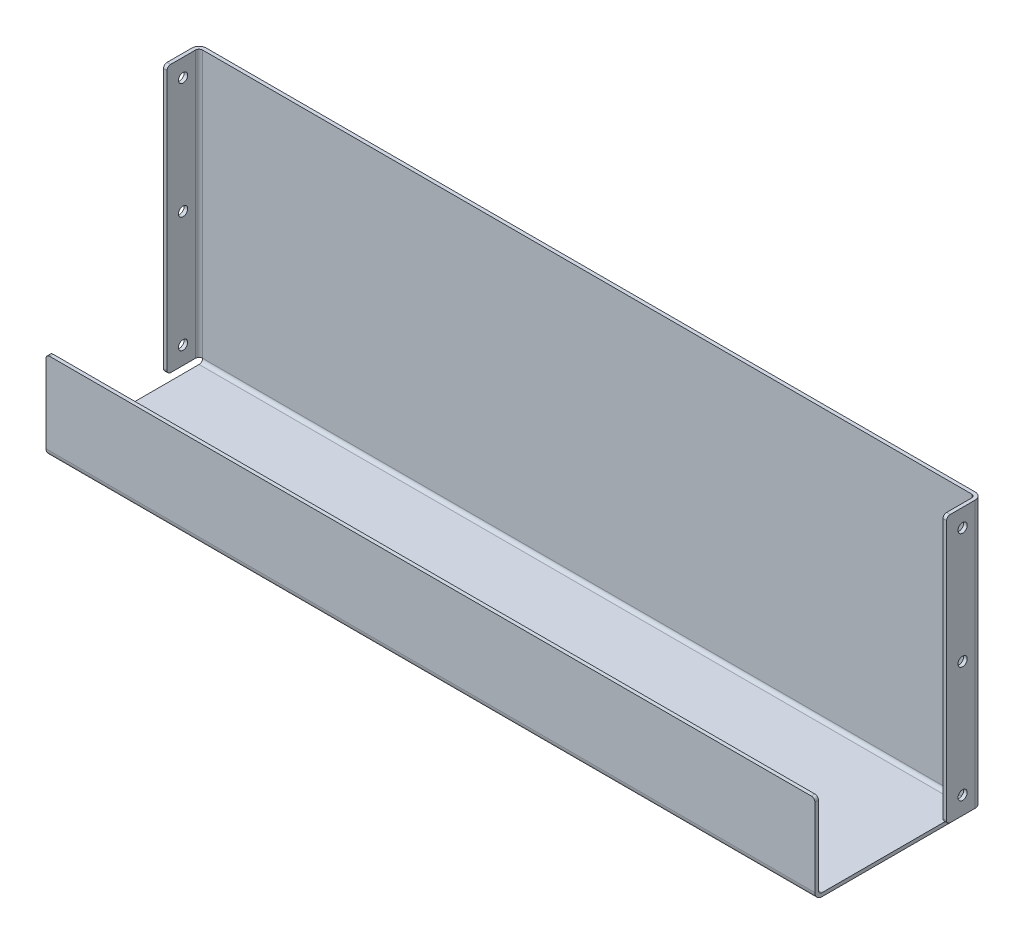
ISO-10303-21;
HEADER;
FILE_DESCRIPTION(('STEP AP214'),'2;1');
FILE_NAME('part.step','',(''),(''),'','','');
FILE_SCHEMA(('AUTOMOTIVE_DESIGN { 1 0 10303 214 1 1 1 1 }'));
ENDSEC;
DATA;
#1=APPLICATION_CONTEXT('core data for automotive mechanical design processes');
#2=APPLICATION_PROTOCOL_DEFINITION('international standard','automotive_design',2000,#1);
#3=PRODUCT_CONTEXT('',#1,'mechanical');
#4=PRODUCT('Part','Part','',(#3));
#5=PRODUCT_RELATED_PRODUCT_CATEGORY('part','',(#4));
#6=PRODUCT_DEFINITION_FORMATION('','',#4);
#7=PRODUCT_DEFINITION_CONTEXT('part definition',#1,'design');
#8=PRODUCT_DEFINITION('design','',#6,#7);
#9=PRODUCT_DEFINITION_SHAPE('','',#8);
#10=(LENGTH_UNIT() NAMED_UNIT(*) SI_UNIT(.MILLI.,.METRE.));
#11=(NAMED_UNIT(*) PLANE_ANGLE_UNIT() SI_UNIT($,.RADIAN.));
#12=(NAMED_UNIT(*) SI_UNIT($,.STERADIAN.) SOLID_ANGLE_UNIT());
#13=UNCERTAINTY_MEASURE_WITH_UNIT(LENGTH_MEASURE(1.E-05),#10,'distance_accuracy_value','');
#14=(GEOMETRIC_REPRESENTATION_CONTEXT(3) GLOBAL_UNCERTAINTY_ASSIGNED_CONTEXT((#13)) GLOBAL_UNIT_ASSIGNED_CONTEXT((#10,
#11,#12)) REPRESENTATION_CONTEXT('',''));
#15=CARTESIAN_POINT('',(0.,0.,0.));
#16=DIRECTION('',(0.,0.,1.));
#17=DIRECTION('',(1.,0.,0.));
#18=AXIS2_PLACEMENT_3D('',#15,#16,#17);
#19=CARTESIAN_POINT('',(0.,0.,88.));
#20=DIRECTION('',(0.,0.,-1.));
#21=DIRECTION('',(-1.,0.,0.));
#22=AXIS2_PLACEMENT_3D('',#19,#20,#21);
#23=PLANE('',#22);
#24=DIRECTION('',(0.,1.,0.));
#25=VECTOR('',#24,1.);
#26=CARTESIAN_POINT('',(-216.,-77.0000000000003,88.));
#27=LINE('',#26,#25);
#28=CARTESIAN_POINT('',(-216.,-75.0000000000003,88.));
#29=VERTEX_POINT('',#28);
#30=CARTESIAN_POINT('',(-216.,-31.0000000000003,88.));
#31=VERTEX_POINT('',#30);
#32=EDGE_CURVE('E185',#29,#31,#27,.T.);
#33=ORIENTED_EDGE('',*,*,#32,.T.);
#34=CARTESIAN_POINT('',(-214.,-31.0000000000003,88.));
#35=DIRECTION('',(0.,0.,-1.));
#36=DIRECTION('',(-1.,0.,0.));
#37=AXIS2_PLACEMENT_3D('',#34,#35,#36);
#38=CIRCLE('',#37,2.);
#39=CARTESIAN_POINT('',(-214.,-29.0000000000003,88.));
#40=VERTEX_POINT('',#39);
#41=EDGE_CURVE('E20',#40,#31,#38,.F.);
#42=ORIENTED_EDGE('',*,*,#41,.F.);
#43=DIRECTION('',(1.,0.,0.));
#44=VECTOR('',#43,1.);
#45=CARTESIAN_POINT('',(-216.,-29.0000000000003,88.));
#46=LINE('',#45,#44);
#47=CARTESIAN_POINT('',(214.,-29.0000000000003,88.));
#48=VERTEX_POINT('',#47);
#49=EDGE_CURVE('E182',#40,#48,#46,.T.);
#50=ORIENTED_EDGE('',*,*,#49,.T.);
#51=CARTESIAN_POINT('',(214.,-31.0000000000003,88.));
#52=DIRECTION('',(0.,0.,-1.));
#53=DIRECTION('',(-1.,0.,0.));
#54=AXIS2_PLACEMENT_3D('',#51,#52,#53);
#55=CIRCLE('',#54,2.);
#56=CARTESIAN_POINT('',(216.,-31.0000000000003,88.));
#57=VERTEX_POINT('',#56);
#58=EDGE_CURVE('E200',#57,#48,#55,.F.);
#59=ORIENTED_EDGE('',*,*,#58,.F.);
#60=DIRECTION('',(0.,1.,0.));
#61=VECTOR('',#60,1.);
#62=CARTESIAN_POINT('',(216.,-29.0000000000003,88.));
#63=LINE('',#62,#61);
#64=CARTESIAN_POINT('',(216.,-75.0000000000003,88.));
#65=VERTEX_POINT('',#64);
#66=EDGE_CURVE('E204',#57,#65,#63,.F.);
#67=ORIENTED_EDGE('',*,*,#66,.T.);
#68=DIRECTION('',(1.,0.,0.));
#69=VECTOR('',#68,1.);
#70=CARTESIAN_POINT('',(216.,-75.0000000000003,88.));
#71=LINE('',#70,#69);
#72=EDGE_CURVE('E338',#65,#29,#71,.F.);
#73=ORIENTED_EDGE('',*,*,#72,.T.);
#74=EDGE_LOOP('',(#33,#42,#50,#59,#67,#73));
#75=FACE_BOUND('',#74,.T.);
#76=ADVANCED_FACE('F17',(#75),#23,.T.);
#77=CARTESIAN_POINT('',(-214.,-31.0000000000003,90.));
#78=DIRECTION('',(0.,0.,-1.));
#79=DIRECTION('',(-1.,0.,0.));
#80=AXIS2_PLACEMENT_3D('',#77,#78,#79);
#81=CYLINDRICAL_SURFACE('',#80,2.);
#82=ORIENTED_EDGE('',*,*,#41,.T.);
#83=DIRECTION('',(0.,0.,-1.));
#84=VECTOR('',#83,1.);
#85=CARTESIAN_POINT('',(-216.,-31.0000000000003,90.));
#86=LINE('',#85,#84);
#87=CARTESIAN_POINT('',(-216.,-31.0000000000003,90.));
#88=VERTEX_POINT('',#87);
#89=EDGE_CURVE('E345',#31,#88,#86,.F.);
#90=ORIENTED_EDGE('',*,*,#89,.T.);
#91=CARTESIAN_POINT('',(-214.,-31.0000000000003,90.));
#92=DIRECTION('',(0.,0.,-1.));
#93=DIRECTION('',(-1.,0.,0.));
#94=AXIS2_PLACEMENT_3D('',#91,#92,#93);
#95=CIRCLE('',#94,2.);
#96=CARTESIAN_POINT('',(-214.,-29.0000000000003,90.));
#97=VERTEX_POINT('',#96);
#98=EDGE_CURVE('E192',#88,#97,#95,.T.);
#99=ORIENTED_EDGE('',*,*,#98,.T.);
#100=DIRECTION('',(0.,0.,-1.));
#101=VECTOR('',#100,1.);
#102=CARTESIAN_POINT('',(-214.,-29.0000000000003,90.));
#103=LINE('',#102,#101);
#104=EDGE_CURVE('E188',#97,#40,#103,.T.);
#105=ORIENTED_EDGE('',*,*,#104,.T.);
#106=EDGE_LOOP('',(#82,#90,#99,#105));
#107=FACE_BOUND('',#106,.T.);
#108=ADVANCED_FACE('F190',(#107),#81,.T.);
#109=CARTESIAN_POINT('',(-216.,-29.0000000000003,90.));
#110=DIRECTION('',(0.,-1.,0.));
#111=DIRECTION('',(0.,0.,-1.));
#112=AXIS2_PLACEMENT_3D('',#109,#110,#111);
#113=PLANE('',#112);
#114=DIRECTION('',(0.,0.,-1.));
#115=VECTOR('',#114,1.);
#116=CARTESIAN_POINT('',(214.,-29.0000000000003,90.));
#117=LINE('',#116,#115);
#118=CARTESIAN_POINT('',(214.,-29.0000000000003,90.));
#119=VERTEX_POINT('',#118);
#120=EDGE_CURVE('E198',#48,#119,#117,.F.);
#121=ORIENTED_EDGE('',*,*,#120,.F.);
#122=ORIENTED_EDGE('',*,*,#49,.F.);
#123=ORIENTED_EDGE('',*,*,#104,.F.);
#124=DIRECTION('',(-1.,0.,0.));
#125=VECTOR('',#124,1.);
#126=CARTESIAN_POINT('',(0.,-29.0000000000003,90.));
#127=LINE('',#126,#125);
#128=EDGE_CURVE('E334',#97,#119,#127,.F.);
#129=ORIENTED_EDGE('',*,*,#128,.T.);
#130=EDGE_LOOP('',(#121,#122,#123,#129));
#131=FACE_BOUND('',#130,.T.);
#132=ADVANCED_FACE('F196',(#131),#113,.F.);
#133=CARTESIAN_POINT('',(214.,-31.0000000000003,90.));
#134=DIRECTION('',(0.,0.,-1.));
#135=DIRECTION('',(-1.,0.,0.));
#136=AXIS2_PLACEMENT_3D('',#133,#134,#135);
#137=CYLINDRICAL_SURFACE('',#136,2.);
#138=ORIENTED_EDGE('',*,*,#58,.T.);
#139=ORIENTED_EDGE('',*,*,#120,.T.);
#140=CARTESIAN_POINT('',(214.,-31.0000000000003,90.));
#141=DIRECTION('',(0.,0.,-1.));
#142=DIRECTION('',(-1.,0.,0.));
#143=AXIS2_PLACEMENT_3D('',#140,#141,#142);
#144=CIRCLE('',#143,2.);
#145=CARTESIAN_POINT('',(216.,-31.0000000000003,90.));
#146=VERTEX_POINT('',#145);
#147=EDGE_CURVE('E332',#119,#146,#144,.T.);
#148=ORIENTED_EDGE('',*,*,#147,.T.);
#149=DIRECTION('',(0.,0.,1.));
#150=VECTOR('',#149,1.);
#151=CARTESIAN_POINT('',(216.,-31.0000000000003,90.));
#152=LINE('',#151,#150);
#153=EDGE_CURVE('E350',#146,#57,#152,.F.);
#154=ORIENTED_EDGE('',*,*,#153,.T.);
#155=EDGE_LOOP('',(#138,#139,#148,#154));
#156=FACE_BOUND('',#155,.T.);
#157=ADVANCED_FACE('F355',(#156),#137,.T.);
#158=CARTESIAN_POINT('',(216.,-75.0000000000003,86.));
#159=DIRECTION('',(1.,0.,0.));
#160=DIRECTION('',(0.,0.,-1.));
#161=AXIS2_PLACEMENT_3D('',#158,#159,#160);
#162=CYLINDRICAL_SURFACE('',#161,2.);
#163=CARTESIAN_POINT('',(-216.,-75.0000000000003,86.));
#164=DIRECTION('',(1.,0.,0.));
#165=DIRECTION('',(0.,0.,-1.));
#166=AXIS2_PLACEMENT_3D('',#163,#164,#165);
#167=CIRCLE('',#166,2.);
#168=CARTESIAN_POINT('',(-216.,-77.0000000000002,86.));
#169=VERTEX_POINT('',#168);
#170=EDGE_CURVE('E328',#29,#169,#167,.T.);
#171=ORIENTED_EDGE('',*,*,#170,.F.);
#172=ORIENTED_EDGE('',*,*,#72,.F.);
#173=CARTESIAN_POINT('',(216.,-75.0000000000003,86.));
#174=DIRECTION('',(1.,0.,0.));
#175=DIRECTION('',(0.,0.,-1.));
#176=AXIS2_PLACEMENT_3D('',#173,#174,#175);
#177=CIRCLE('',#176,2.);
#178=CARTESIAN_POINT('',(216.,-77.0000000000003,86.));
#179=VERTEX_POINT('',#178);
#180=EDGE_CURVE('E337',#65,#179,#177,.T.);
#181=ORIENTED_EDGE('',*,*,#180,.T.);
#182=DIRECTION('',(1.,0.,0.));
#183=VECTOR('',#182,1.);
#184=CARTESIAN_POINT('',(0.,-77.0000000000003,86.));
#185=LINE('',#184,#183);
#186=EDGE_CURVE('E327',#169,#179,#185,.T.);
#187=ORIENTED_EDGE('',*,*,#186,.F.);
#188=EDGE_LOOP('',(#171,#172,#181,#187));
#189=FACE_BOUND('',#188,.T.);
#190=ADVANCED_FACE('F514',(#189),#162,.F.);
#191=CARTESIAN_POINT('',(218.,0.,-6.78469626159817E-13));
#192=DIRECTION('',(-1.,0.,0.));
#193=DIRECTION('',(0.,0.,1.));
#194=AXIS2_PLACEMENT_3D('',#191,#192,#193);
#195=PLANE('',#194);
#196=DIRECTION('',(0.,0.,1.));
#197=VECTOR('',#196,1.);
#198=CARTESIAN_POINT('',(218.,-75.,1.99999999999999));
#199=LINE('',#198,#197);
#200=CARTESIAN_POINT('',(218.,-75.,4.));
#201=VERTEX_POINT('',#200);
#202=CARTESIAN_POINT('',(218.,-75.,18.));
#203=VERTEX_POINT('',#202);
#204=EDGE_CURVE('E375',#201,#203,#199,.T.);
#205=ORIENTED_EDGE('',*,*,#204,.T.);
#206=CARTESIAN_POINT('',(218.,-73.,18.));
#207=DIRECTION('',(-1.,0.,0.));
#208=DIRECTION('',(0.,0.,1.));
#209=AXIS2_PLACEMENT_3D('',#206,#207,#208);
#210=CIRCLE('',#209,2.);
#211=CARTESIAN_POINT('',(218.,-73.,20.));
#212=VERTEX_POINT('',#211);
#213=EDGE_CURVE('E314',#212,#203,#210,.F.);
#214=ORIENTED_EDGE('',*,*,#213,.F.);
#215=DIRECTION('',(0.,1.,0.));
#216=VECTOR('',#215,1.);
#217=CARTESIAN_POINT('',(218.,-75.,20.));
#218=LINE('',#217,#216);
#219=CARTESIAN_POINT('',(218.,73.,20.));
#220=VERTEX_POINT('',#219);
#221=EDGE_CURVE('E313',#212,#220,#218,.T.);
#222=ORIENTED_EDGE('',*,*,#221,.T.);
#223=CARTESIAN_POINT('',(218.,73.,18.));
#224=DIRECTION('',(-1.,0.,0.));
#225=DIRECTION('',(0.,0.,1.));
#226=AXIS2_PLACEMENT_3D('',#223,#224,#225);
#227=CIRCLE('',#226,2.);
#228=CARTESIAN_POINT('',(218.,75.,18.));
#229=VERTEX_POINT('',#228);
#230=EDGE_CURVE('E309',#229,#220,#227,.F.);
#231=ORIENTED_EDGE('',*,*,#230,.F.);
#232=DIRECTION('',(0.,0.,1.));
#233=VECTOR('',#232,1.);
#234=CARTESIAN_POINT('',(218.,75.,20.));
#235=LINE('',#234,#233);
#236=CARTESIAN_POINT('',(218.,75.,4.));
#237=VERTEX_POINT('',#236);
#238=EDGE_CURVE('E373',#229,#237,#235,.F.);
#239=ORIENTED_EDGE('',*,*,#238,.T.);
#240=DIRECTION('',(0.,1.,0.));
#241=VECTOR('',#240,1.);
#242=CARTESIAN_POINT('',(218.,75.,4.));
#243=LINE('',#242,#241);
#244=EDGE_CURVE('E379',#237,#201,#243,.F.);
#245=ORIENTED_EDGE('',*,*,#244,.T.);
#246=EDGE_LOOP('',(#205,#214,#222,#231,#239,#245));
#247=FACE_BOUND('',#246,.T.);
#248=CARTESIAN_POINT('',(218.,65.0000000000001,11.0000000000013));
#249=DIRECTION('',(-1.,0.,0.));
#250=DIRECTION('',(0.,0.,1.));
#251=AXIS2_PLACEMENT_3D('',#248,#249,#250);
#252=CIRCLE('',#251,2.6);
#253=CARTESIAN_POINT('',(218.,65.0000000000001,13.6000000000013));
#254=VERTEX_POINT('',#253);
#255=EDGE_CURVE('E318',#254,#254,#252,.F.);
#256=ORIENTED_EDGE('',*,*,#255,.T.);
#257=EDGE_LOOP('',(#256));
#258=FACE_BOUND('',#257,.T.);
#259=CARTESIAN_POINT('',(218.,0.,11.0000000000013));
#260=DIRECTION('',(-1.,0.,0.));
#261=DIRECTION('',(0.,0.,1.));
#262=AXIS2_PLACEMENT_3D('',#259,#260,#261);
#263=CIRCLE('',#262,2.6);
#264=CARTESIAN_POINT('',(218.,0.,13.6000000000013));
#265=VERTEX_POINT('',#264);
#266=EDGE_CURVE('E321',#265,#265,#263,.F.);
#267=ORIENTED_EDGE('',*,*,#266,.T.);
#268=EDGE_LOOP('',(#267));
#269=FACE_BOUND('',#268,.T.);
#270=CARTESIAN_POINT('',(218.,-64.9999999999999,11.0000000000013));
#271=DIRECTION('',(-1.,0.,0.));
#272=DIRECTION('',(0.,0.,1.));
#273=AXIS2_PLACEMENT_3D('',#270,#271,#272);
#274=CIRCLE('',#273,2.6);
#275=CARTESIAN_POINT('',(218.,-64.9999999999999,13.6000000000013));
#276=VERTEX_POINT('',#275);
#277=EDGE_CURVE('E324',#276,#276,#274,.F.);
#278=ORIENTED_EDGE('',*,*,#277,.T.);
#279=EDGE_LOOP('',(#278));
#280=FACE_BOUND('',#279,.T.);
#281=ADVANCED_FACE('F516',(#247,#258,#269,#280),#195,.T.);
#282=CARTESIAN_POINT('',(0.,0.,90.));
#283=DIRECTION('',(0.,0.,-1.));
#284=DIRECTION('',(-1.,0.,0.));
#285=AXIS2_PLACEMENT_3D('',#282,#283,#284);
#286=PLANE('',#285);
#287=ORIENTED_EDGE('',*,*,#147,.F.);
#288=ORIENTED_EDGE('',*,*,#128,.F.);
#289=ORIENTED_EDGE('',*,*,#98,.F.);
#290=DIRECTION('',(0.,1.,0.));
#291=VECTOR('',#290,1.);
#292=CARTESIAN_POINT('',(-216.,0.,90.));
#293=LINE('',#292,#291);
#294=CARTESIAN_POINT('',(-216.,-75.0000000000003,90.));
#295=VERTEX_POINT('',#294);
#296=EDGE_CURVE('E336',#295,#88,#293,.T.);
#297=ORIENTED_EDGE('',*,*,#296,.F.);
#298=DIRECTION('',(1.,0.,0.));
#299=VECTOR('',#298,1.);
#300=CARTESIAN_POINT('',(216.,-75.0000000000003,90.));
#301=LINE('',#300,#299);
#302=CARTESIAN_POINT('',(216.,-75.0000000000003,90.));
#303=VERTEX_POINT('',#302);
#304=EDGE_CURVE('E304',#303,#295,#301,.F.);
#305=ORIENTED_EDGE('',*,*,#304,.F.);
#306=DIRECTION('',(0.,1.,0.));
#307=VECTOR('',#306,1.);
#308=CARTESIAN_POINT('',(216.,0.,90.));
#309=LINE('',#308,#307);
#310=EDGE_CURVE('E331',#146,#303,#309,.F.);
#311=ORIENTED_EDGE('',*,*,#310,.F.);
#312=EDGE_LOOP('',(#287,#288,#289,#297,#305,#311));
#313=FACE_BOUND('',#312,.T.);
#314=ADVANCED_FACE('F359',(#313),#286,.F.);
#315=CARTESIAN_POINT('',(0.,-77.,-2.60208521396521E-13));
#316=DIRECTION('',(0.,1.,0.));
#317=DIRECTION('',(0.,0.,1.));
#318=AXIS2_PLACEMENT_3D('',#315,#316,#317);
#319=PLANE('',#318);
#320=DIRECTION('',(0.,0.,1.));
#321=VECTOR('',#320,1.);
#322=CARTESIAN_POINT('',(216.,-77.0000000000003,90.));
#323=LINE('',#322,#321);
#324=CARTESIAN_POINT('',(216.,-77.0000000000001,4.));
#325=VERTEX_POINT('',#324);
#326=EDGE_CURVE('E308',#179,#325,#323,.F.);
#327=ORIENTED_EDGE('',*,*,#326,.T.);
#328=DIRECTION('',(1.,0.,0.));
#329=VECTOR('',#328,1.);
#330=CARTESIAN_POINT('',(216.,-77.,3.99999999999999));
#331=LINE('',#330,#329);
#332=CARTESIAN_POINT('',(-216.,-77.,3.99999999999999));
#333=VERTEX_POINT('',#332);
#334=EDGE_CURVE('E299',#325,#333,#331,.F.);
#335=ORIENTED_EDGE('',*,*,#334,.T.);
#336=DIRECTION('',(0.,0.,1.));
#337=VECTOR('',#336,1.);
#338=CARTESIAN_POINT('',(-216.,-77.,1.99999999999997));
#339=LINE('',#338,#337);
#340=EDGE_CURVE('E303',#333,#169,#339,.T.);
#341=ORIENTED_EDGE('',*,*,#340,.T.);
#342=ORIENTED_EDGE('',*,*,#186,.T.);
#343=EDGE_LOOP('',(#327,#335,#341,#342));
#344=FACE_BOUND('',#343,.T.);
#345=ADVANCED_FACE('F511',(#344),#319,.T.);
#346=CARTESIAN_POINT('',(-218.,0.,-6.78469626159818E-13));
#347=DIRECTION('',(1.,0.,0.));
#348=DIRECTION('',(0.,0.,-1.));
#349=AXIS2_PLACEMENT_3D('',#346,#347,#348);
#350=PLANE('',#349);
#351=DIRECTION('',(0.,0.,1.));
#352=VECTOR('',#351,1.);
#353=CARTESIAN_POINT('',(-218.,75.,1.99999999999999));
#354=LINE('',#353,#352);
#355=CARTESIAN_POINT('',(-218.,75.,4.));
#356=VERTEX_POINT('',#355);
#357=CARTESIAN_POINT('',(-218.,75.,18.));
#358=VERTEX_POINT('',#357);
#359=EDGE_CURVE('E397',#356,#358,#354,.T.);
#360=ORIENTED_EDGE('',*,*,#359,.T.);
#361=CARTESIAN_POINT('',(-218.,73.,18.));
#362=DIRECTION('',(1.,0.,0.));
#363=DIRECTION('',(0.,0.,-1.));
#364=AXIS2_PLACEMENT_3D('',#361,#362,#363);
#365=CIRCLE('',#364,2.);
#366=CARTESIAN_POINT('',(-218.,73.,20.));
#367=VERTEX_POINT('',#366);
#368=EDGE_CURVE('E286',#367,#358,#365,.F.);
#369=ORIENTED_EDGE('',*,*,#368,.F.);
#370=DIRECTION('',(0.,1.,0.));
#371=VECTOR('',#370,1.);
#372=CARTESIAN_POINT('',(-218.,75.,20.));
#373=LINE('',#372,#371);
#374=CARTESIAN_POINT('',(-218.,-73.,20.));
#375=VERTEX_POINT('',#374);
#376=EDGE_CURVE('E285',#367,#375,#373,.F.);
#377=ORIENTED_EDGE('',*,*,#376,.T.);
#378=CARTESIAN_POINT('',(-218.,-73.,18.));
#379=DIRECTION('',(1.,0.,0.));
#380=DIRECTION('',(0.,0.,-1.));
#381=AXIS2_PLACEMENT_3D('',#378,#379,#380);
#382=CIRCLE('',#381,2.);
#383=CARTESIAN_POINT('',(-218.,-75.,18.));
#384=VERTEX_POINT('',#383);
#385=EDGE_CURVE('E281',#384,#375,#382,.F.);
#386=ORIENTED_EDGE('',*,*,#385,.F.);
#387=DIRECTION('',(0.,0.,1.));
#388=VECTOR('',#387,1.);
#389=CARTESIAN_POINT('',(-218.,-75.,20.));
#390=LINE('',#389,#388);
#391=CARTESIAN_POINT('',(-218.,-75.,4.));
#392=VERTEX_POINT('',#391);
#393=EDGE_CURVE('E395',#384,#392,#390,.F.);
#394=ORIENTED_EDGE('',*,*,#393,.T.);
#395=DIRECTION('',(0.,-1.,0.));
#396=VECTOR('',#395,1.);
#397=CARTESIAN_POINT('',(-218.,-75.,4.));
#398=LINE('',#397,#396);
#399=EDGE_CURVE('E372',#392,#356,#398,.F.);
#400=ORIENTED_EDGE('',*,*,#399,.T.);
#401=EDGE_LOOP('',(#360,#369,#377,#386,#394,#400));
#402=FACE_BOUND('',#401,.T.);
#403=CARTESIAN_POINT('',(-218.,65.,11.));
#404=DIRECTION('',(-1.,0.,0.));
#405=DIRECTION('',(0.,0.,1.));
#406=AXIS2_PLACEMENT_3D('',#403,#404,#405);
#407=CIRCLE('',#406,2.6);
#408=CARTESIAN_POINT('',(-218.,65.,13.6));
#409=VERTEX_POINT('',#408);
#410=EDGE_CURVE('E290',#409,#409,#407,.T.);
#411=ORIENTED_EDGE('',*,*,#410,.T.);
#412=EDGE_LOOP('',(#411));
#413=FACE_BOUND('',#412,.T.);
#414=CARTESIAN_POINT('',(-218.,0.,11.));
#415=DIRECTION('',(-1.,0.,0.));
#416=DIRECTION('',(0.,0.,1.));
#417=AXIS2_PLACEMENT_3D('',#414,#415,#416);
#418=CIRCLE('',#417,2.6);
#419=CARTESIAN_POINT('',(-218.,0.,13.6));
#420=VERTEX_POINT('',#419);
#421=EDGE_CURVE('E293',#420,#420,#418,.T.);
#422=ORIENTED_EDGE('',*,*,#421,.T.);
#423=EDGE_LOOP('',(#422));
#424=FACE_BOUND('',#423,.T.);
#425=CARTESIAN_POINT('',(-218.,-65.,11.));
#426=DIRECTION('',(-1.,0.,0.));
#427=DIRECTION('',(0.,0.,1.));
#428=AXIS2_PLACEMENT_3D('',#425,#426,#427);
#429=CIRCLE('',#428,2.6);
#430=CARTESIAN_POINT('',(-218.,-65.,13.6));
#431=VERTEX_POINT('',#430);
#432=EDGE_CURVE('E296',#431,#431,#429,.T.);
#433=ORIENTED_EDGE('',*,*,#432,.T.);
#434=EDGE_LOOP('',(#433));
#435=FACE_BOUND('',#434,.T.);
#436=ADVANCED_FACE('F613',(#402,#413,#424,#435),#350,.T.);
#437=CARTESIAN_POINT('',(220.,-64.9999999999999,11.0000000000014));
#438=DIRECTION('',(-1.,0.,0.));
#439=DIRECTION('',(0.,0.,1.));
#440=AXIS2_PLACEMENT_3D('',#437,#438,#439);
#441=CYLINDRICAL_SURFACE('',#440,2.6);
#442=CARTESIAN_POINT('',(220.,-64.9999999999999,11.0000000000014));
#443=DIRECTION('',(-1.,0.,0.));
#444=DIRECTION('',(0.,0.,1.));
#445=AXIS2_PLACEMENT_3D('',#442,#443,#444);
#446=CIRCLE('',#445,2.6);
#447=CARTESIAN_POINT('',(220.,-64.9999999999999,13.6000000000014));
#448=VERTEX_POINT('',#447);
#449=EDGE_CURVE('E275',#448,#448,#446,.F.);
#450=ORIENTED_EDGE('',*,*,#449,.T.);
#451=EDGE_LOOP('',(#450));
#452=FACE_BOUND('',#451,.T.);
#453=ORIENTED_EDGE('',*,*,#277,.F.);
#454=EDGE_LOOP('',(#453));
#455=FACE_BOUND('',#454,.T.);
#456=ADVANCED_FACE('F609',(#452,#455),#441,.F.);
#457=CARTESIAN_POINT('',(220.,0.,11.0000000000014));
#458=DIRECTION('',(-1.,0.,0.));
#459=DIRECTION('',(0.,0.,1.));
#460=AXIS2_PLACEMENT_3D('',#457,#458,#459);
#461=CYLINDRICAL_SURFACE('',#460,2.6);
#462=CARTESIAN_POINT('',(220.,0.,11.0000000000014));
#463=DIRECTION('',(-1.,0.,0.));
#464=DIRECTION('',(0.,0.,1.));
#465=AXIS2_PLACEMENT_3D('',#462,#463,#464);
#466=CIRCLE('',#465,2.6);
#467=CARTESIAN_POINT('',(220.,0.,13.6000000000014));
#468=VERTEX_POINT('',#467);
#469=EDGE_CURVE('E272',#468,#468,#466,.F.);
#470=ORIENTED_EDGE('',*,*,#469,.T.);
#471=EDGE_LOOP('',(#470));
#472=FACE_BOUND('',#471,.T.);
#473=ORIENTED_EDGE('',*,*,#266,.F.);
#474=EDGE_LOOP('',(#473));
#475=FACE_BOUND('',#474,.T.);
#476=ADVANCED_FACE('F605',(#472,#475),#461,.F.);
#477=CARTESIAN_POINT('',(220.,65.0000000000001,11.0000000000013));
#478=DIRECTION('',(-1.,0.,0.));
#479=DIRECTION('',(0.,0.,1.));
#480=AXIS2_PLACEMENT_3D('',#477,#478,#479);
#481=CYLINDRICAL_SURFACE('',#480,2.6);
#482=CARTESIAN_POINT('',(220.,65.0000000000001,11.0000000000013));
#483=DIRECTION('',(-1.,0.,0.));
#484=DIRECTION('',(0.,0.,1.));
#485=AXIS2_PLACEMENT_3D('',#482,#483,#484);
#486=CIRCLE('',#485,2.6);
#487=CARTESIAN_POINT('',(220.,65.0000000000001,13.6000000000013));
#488=VERTEX_POINT('',#487);
#489=EDGE_CURVE('E269',#488,#488,#486,.F.);
#490=ORIENTED_EDGE('',*,*,#489,.T.);
#491=EDGE_LOOP('',(#490));
#492=FACE_BOUND('',#491,.T.);
#493=ORIENTED_EDGE('',*,*,#255,.F.);
#494=EDGE_LOOP('',(#493));
#495=FACE_BOUND('',#494,.T.);
#496=ADVANCED_FACE('F601',(#492,#495),#481,.F.);
#497=CARTESIAN_POINT('',(220.,-73.,18.));
#498=DIRECTION('',(-1.,0.,0.));
#499=DIRECTION('',(0.,0.,1.));
#500=AXIS2_PLACEMENT_3D('',#497,#498,#499);
#501=CYLINDRICAL_SURFACE('',#500,2.);
#502=ORIENTED_EDGE('',*,*,#213,.T.);
#503=DIRECTION('',(-1.,0.,0.));
#504=VECTOR('',#503,1.);
#505=CARTESIAN_POINT('',(220.,-75.,18.));
#506=LINE('',#505,#504);
#507=CARTESIAN_POINT('',(220.,-75.,18.));
#508=VERTEX_POINT('',#507);
#509=EDGE_CURVE('E377',#203,#508,#506,.F.);
#510=ORIENTED_EDGE('',*,*,#509,.T.);
#511=CARTESIAN_POINT('',(220.,-73.,18.));
#512=DIRECTION('',(-1.,0.,0.));
#513=DIRECTION('',(0.,0.,1.));
#514=AXIS2_PLACEMENT_3D('',#511,#512,#513);
#515=CIRCLE('',#514,2.);
#516=CARTESIAN_POINT('',(220.,-73.,20.));
#517=VERTEX_POINT('',#516);
#518=EDGE_CURVE('E266',#508,#517,#515,.T.);
#519=ORIENTED_EDGE('',*,*,#518,.T.);
#520=DIRECTION('',(-1.,0.,0.));
#521=VECTOR('',#520,1.);
#522=CARTESIAN_POINT('',(220.,-73.,20.));
#523=LINE('',#522,#521);
#524=EDGE_CURVE('E317',#517,#212,#523,.T.);
#525=ORIENTED_EDGE('',*,*,#524,.T.);
#526=EDGE_LOOP('',(#502,#510,#519,#525));
#527=FACE_BOUND('',#526,.T.);
#528=ADVANCED_FACE('F597',(#527),#501,.T.);
#529=CARTESIAN_POINT('',(220.,-75.,20.));
#530=DIRECTION('',(0.,0.,-1.));
#531=DIRECTION('',(-1.,0.,0.));
#532=AXIS2_PLACEMENT_3D('',#529,#530,#531);
#533=PLANE('',#532);
#534=DIRECTION('',(-1.,0.,0.));
#535=VECTOR('',#534,1.);
#536=CARTESIAN_POINT('',(220.,73.,20.));
#537=LINE('',#536,#535);
#538=CARTESIAN_POINT('',(220.,73.,20.));
#539=VERTEX_POINT('',#538);
#540=EDGE_CURVE('E312',#220,#539,#537,.F.);
#541=ORIENTED_EDGE('',*,*,#540,.F.);
#542=ORIENTED_EDGE('',*,*,#221,.F.);
#543=ORIENTED_EDGE('',*,*,#524,.F.);
#544=DIRECTION('',(0.,1.,0.));
#545=VECTOR('',#544,1.);
#546=CARTESIAN_POINT('',(220.,0.,20.));
#547=LINE('',#546,#545);
#548=EDGE_CURVE('E265',#517,#539,#547,.T.);
#549=ORIENTED_EDGE('',*,*,#548,.T.);
#550=EDGE_LOOP('',(#541,#542,#543,#549));
#551=FACE_BOUND('',#550,.T.);
#552=ADVANCED_FACE('F593',(#551),#533,.F.);
#553=CARTESIAN_POINT('',(220.,73.,18.));
#554=DIRECTION('',(-1.,0.,0.));
#555=DIRECTION('',(0.,0.,1.));
#556=AXIS2_PLACEMENT_3D('',#553,#554,#555);
#557=CYLINDRICAL_SURFACE('',#556,2.);
#558=ORIENTED_EDGE('',*,*,#230,.T.);
#559=ORIENTED_EDGE('',*,*,#540,.T.);
#560=CARTESIAN_POINT('',(220.,73.,18.));
#561=DIRECTION('',(-1.,0.,0.));
#562=DIRECTION('',(0.,0.,1.));
#563=AXIS2_PLACEMENT_3D('',#560,#561,#562);
#564=CIRCLE('',#563,2.);
#565=CARTESIAN_POINT('',(220.,75.,18.));
#566=VERTEX_POINT('',#565);
#567=EDGE_CURVE('E263',#539,#566,#564,.T.);
#568=ORIENTED_EDGE('',*,*,#567,.T.);
#569=DIRECTION('',(1.,0.,0.));
#570=VECTOR('',#569,1.);
#571=CARTESIAN_POINT('',(220.,75.,18.));
#572=LINE('',#571,#570);
#573=EDGE_CURVE('E376',#566,#229,#572,.F.);
#574=ORIENTED_EDGE('',*,*,#573,.T.);
#575=EDGE_LOOP('',(#558,#559,#568,#574));
#576=FACE_BOUND('',#575,.T.);
#577=ADVANCED_FACE('F590',(#576),#557,.T.);
#578=CARTESIAN_POINT('',(216.,75.,4.00000000000001));
#579=DIRECTION('',(0.,1.,0.));
#580=DIRECTION('',(0.,0.,1.));
#581=AXIS2_PLACEMENT_3D('',#578,#579,#580);
#582=CYLINDRICAL_SURFACE('',#581,2.);
#583=CARTESIAN_POINT('',(216.,-75.,4.00000000000001));
#584=DIRECTION('',(0.,1.,0.));
#585=DIRECTION('',(0.,0.,1.));
#586=AXIS2_PLACEMENT_3D('',#583,#584,#585);
#587=CIRCLE('',#586,2.);
#588=CARTESIAN_POINT('',(216.,-75.,1.99999999999999));
#589=VERTEX_POINT('',#588);
#590=EDGE_CURVE('E259',#201,#589,#587,.T.);
#591=ORIENTED_EDGE('',*,*,#590,.F.);
#592=ORIENTED_EDGE('',*,*,#244,.F.);
#593=CARTESIAN_POINT('',(216.,75.,4.00000000000001));
#594=DIRECTION('',(0.,1.,0.));
#595=DIRECTION('',(0.,0.,1.));
#596=AXIS2_PLACEMENT_3D('',#593,#594,#595);
#597=CIRCLE('',#596,2.);
#598=CARTESIAN_POINT('',(216.,75.,2.));
#599=VERTEX_POINT('',#598);
#600=EDGE_CURVE('E278',#237,#599,#597,.T.);
#601=ORIENTED_EDGE('',*,*,#600,.T.);
#602=DIRECTION('',(0.,1.,0.));
#603=VECTOR('',#602,1.);
#604=CARTESIAN_POINT('',(216.,0.,2.));
#605=LINE('',#604,#603);
#606=EDGE_CURVE('E280',#599,#589,#605,.F.);
#607=ORIENTED_EDGE('',*,*,#606,.T.);
#608=EDGE_LOOP('',(#591,#592,#601,#607));
#609=FACE_BOUND('',#608,.T.);
#610=ADVANCED_FACE('F587',(#609),#582,.F.);
#611=CARTESIAN_POINT('',(216.,-75.0000000000003,86.));
#612=DIRECTION('',(1.,0.,0.));
#613=DIRECTION('',(0.,0.,-1.));
#614=AXIS2_PLACEMENT_3D('',#611,#612,#613);
#615=CYLINDRICAL_SURFACE('',#614,4.);
#616=ORIENTED_EDGE('',*,*,#304,.T.);
#617=CARTESIAN_POINT('',(-216.,-75.0000000000003,86.));
#618=DIRECTION('',(1.,0.,0.));
#619=DIRECTION('',(0.,0.,-1.));
#620=AXIS2_PLACEMENT_3D('',#617,#618,#619);
#621=CIRCLE('',#620,4.);
#622=CARTESIAN_POINT('',(-216.,-79.0000000000003,86.));
#623=VERTEX_POINT('',#622);
#624=EDGE_CURVE('E300',#295,#623,#621,.T.);
#625=ORIENTED_EDGE('',*,*,#624,.T.);
#626=DIRECTION('',(1.,0.,0.));
#627=VECTOR('',#626,1.);
#628=CARTESIAN_POINT('',(0.,-79.0000000000003,86.));
#629=LINE('',#628,#627);
#630=CARTESIAN_POINT('',(216.,-79.0000000000003,86.));
#631=VERTEX_POINT('',#630);
#632=EDGE_CURVE('E253',#623,#631,#629,.T.);
#633=ORIENTED_EDGE('',*,*,#632,.T.);
#634=CARTESIAN_POINT('',(216.,-75.0000000000003,86.));
#635=DIRECTION('',(1.,0.,0.));
#636=DIRECTION('',(0.,0.,-1.));
#637=AXIS2_PLACEMENT_3D('',#634,#635,#636);
#638=CIRCLE('',#637,4.);
#639=EDGE_CURVE('E305',#631,#303,#638,.F.);
#640=ORIENTED_EDGE('',*,*,#639,.T.);
#641=EDGE_LOOP('',(#616,#625,#633,#640));
#642=FACE_BOUND('',#641,.T.);
#643=ADVANCED_FACE('F474',(#642),#615,.T.);
#644=CARTESIAN_POINT('',(216.,-75.,4.));
#645=DIRECTION('',(1.,0.,0.));
#646=DIRECTION('',(0.,0.,-1.));
#647=AXIS2_PLACEMENT_3D('',#644,#645,#646);
#648=CYLINDRICAL_SURFACE('',#647,2.00000000000002);
#649=CARTESIAN_POINT('',(-216.,-75.,4.));
#650=DIRECTION('',(1.,0.,0.));
#651=DIRECTION('',(0.,0.,-1.));
#652=AXIS2_PLACEMENT_3D('',#649,#650,#651);
#653=CIRCLE('',#652,2.00000000000002);
#654=CARTESIAN_POINT('',(-216.,-75.,2.));
#655=VERTEX_POINT('',#654);
#656=EDGE_CURVE('E251',#333,#655,#653,.T.);
#657=ORIENTED_EDGE('',*,*,#656,.F.);
#658=ORIENTED_EDGE('',*,*,#334,.F.);
#659=CARTESIAN_POINT('',(216.,-75.,4.));
#660=DIRECTION('',(1.,0.,0.));
#661=DIRECTION('',(0.,0.,-1.));
#662=AXIS2_PLACEMENT_3D('',#659,#660,#661);
#663=CIRCLE('',#662,2.00000000000002);
#664=EDGE_CURVE('E254',#325,#589,#663,.T.);
#665=ORIENTED_EDGE('',*,*,#664,.T.);
#666=DIRECTION('',(-1.,0.,0.));
#667=VECTOR('',#666,1.);
#668=CARTESIAN_POINT('',(0.,-75.,2.));
#669=LINE('',#668,#667);
#670=EDGE_CURVE('E369',#589,#655,#669,.T.);
#671=ORIENTED_EDGE('',*,*,#670,.T.);
#672=EDGE_LOOP('',(#657,#658,#665,#671));
#673=FACE_BOUND('',#672,.T.);
#674=ADVANCED_FACE('F499',(#673),#648,.F.);
#675=CARTESIAN_POINT('',(220.,-64.9999999999999,11.0000000000014));
#676=DIRECTION('',(-1.,0.,0.));
#677=DIRECTION('',(0.,0.,1.));
#678=AXIS2_PLACEMENT_3D('',#675,#676,#677);
#679=CYLINDRICAL_SURFACE('',#678,2.6);
#680=ORIENTED_EDGE('',*,*,#432,.F.);
#681=EDGE_LOOP('',(#680));
#682=FACE_BOUND('',#681,.T.);
#683=CARTESIAN_POINT('',(-220.,-65.,11.));
#684=DIRECTION('',(-1.,0.,0.));
#685=DIRECTION('',(0.,0.,1.));
#686=AXIS2_PLACEMENT_3D('',#683,#684,#685);
#687=CIRCLE('',#686,2.6);
#688=CARTESIAN_POINT('',(-220.,-65.,13.6));
#689=VERTEX_POINT('',#688);
#690=EDGE_CURVE('E245',#689,#689,#687,.T.);
#691=ORIENTED_EDGE('',*,*,#690,.T.);
#692=EDGE_LOOP('',(#691));
#693=FACE_BOUND('',#692,.T.);
#694=ADVANCED_FACE('F578',(#682,#693),#679,.F.);
#695=CARTESIAN_POINT('',(220.,0.,11.0000000000014));
#696=DIRECTION('',(-1.,0.,0.));
#697=DIRECTION('',(0.,0.,1.));
#698=AXIS2_PLACEMENT_3D('',#695,#696,#697);
#699=CYLINDRICAL_SURFACE('',#698,2.6);
#700=ORIENTED_EDGE('',*,*,#421,.F.);
#701=EDGE_LOOP('',(#700));
#702=FACE_BOUND('',#701,.T.);
#703=CARTESIAN_POINT('',(-220.,0.,11.));
#704=DIRECTION('',(-1.,0.,0.));
#705=DIRECTION('',(0.,0.,1.));
#706=AXIS2_PLACEMENT_3D('',#703,#704,#705);
#707=CIRCLE('',#706,2.6);
#708=CARTESIAN_POINT('',(-220.,0.,13.6));
#709=VERTEX_POINT('',#708);
#710=EDGE_CURVE('E242',#709,#709,#707,.T.);
#711=ORIENTED_EDGE('',*,*,#710,.T.);
#712=EDGE_LOOP('',(#711));
#713=FACE_BOUND('',#712,.T.);
#714=ADVANCED_FACE('F574',(#702,#713),#699,.F.);
#715=CARTESIAN_POINT('',(220.,65.0000000000001,11.0000000000013));
#716=DIRECTION('',(-1.,0.,0.));
#717=DIRECTION('',(0.,0.,1.));
#718=AXIS2_PLACEMENT_3D('',#715,#716,#717);
#719=CYLINDRICAL_SURFACE('',#718,2.6);
#720=ORIENTED_EDGE('',*,*,#410,.F.);
#721=EDGE_LOOP('',(#720));
#722=FACE_BOUND('',#721,.T.);
#723=CARTESIAN_POINT('',(-220.,65.,11.));
#724=DIRECTION('',(-1.,0.,0.));
#725=DIRECTION('',(0.,0.,1.));
#726=AXIS2_PLACEMENT_3D('',#723,#724,#725);
#727=CIRCLE('',#726,2.6);
#728=CARTESIAN_POINT('',(-220.,65.,13.6));
#729=VERTEX_POINT('',#728);
#730=EDGE_CURVE('E239',#729,#729,#727,.T.);
#731=ORIENTED_EDGE('',*,*,#730,.T.);
#732=EDGE_LOOP('',(#731));
#733=FACE_BOUND('',#732,.T.);
#734=ADVANCED_FACE('F570',(#722,#733),#719,.F.);
#735=CARTESIAN_POINT('',(-220.,73.,18.));
#736=DIRECTION('',(1.,0.,0.));
#737=DIRECTION('',(0.,0.,-1.));
#738=AXIS2_PLACEMENT_3D('',#735,#736,#737);
#739=CYLINDRICAL_SURFACE('',#738,2.);
#740=ORIENTED_EDGE('',*,*,#368,.T.);
#741=DIRECTION('',(1.,0.,0.));
#742=VECTOR('',#741,1.);
#743=CARTESIAN_POINT('',(-220.,75.,18.));
#744=LINE('',#743,#742);
#745=CARTESIAN_POINT('',(-220.,75.,18.));
#746=VERTEX_POINT('',#745);
#747=EDGE_CURVE('E399',#358,#746,#744,.F.);
#748=ORIENTED_EDGE('',*,*,#747,.T.);
#749=CARTESIAN_POINT('',(-220.,73.,18.));
#750=DIRECTION('',(1.,0.,0.));
#751=DIRECTION('',(0.,0.,-1.));
#752=AXIS2_PLACEMENT_3D('',#749,#750,#751);
#753=CIRCLE('',#752,2.);
#754=CARTESIAN_POINT('',(-220.,73.,20.));
#755=VERTEX_POINT('',#754);
#756=EDGE_CURVE('E236',#746,#755,#753,.T.);
#757=ORIENTED_EDGE('',*,*,#756,.T.);
#758=DIRECTION('',(-1.,0.,0.));
#759=VECTOR('',#758,1.);
#760=CARTESIAN_POINT('',(-220.,73.,20.));
#761=LINE('',#760,#759);
#762=EDGE_CURVE('E289',#755,#367,#761,.F.);
#763=ORIENTED_EDGE('',*,*,#762,.T.);
#764=EDGE_LOOP('',(#740,#748,#757,#763));
#765=FACE_BOUND('',#764,.T.);
#766=ADVANCED_FACE('F566',(#765),#739,.T.);
#767=CARTESIAN_POINT('',(-220.,75.,20.));
#768=DIRECTION('',(0.,0.,-1.));
#769=DIRECTION('',(-1.,0.,0.));
#770=AXIS2_PLACEMENT_3D('',#767,#768,#769);
#771=PLANE('',#770);
#772=DIRECTION('',(1.,0.,0.));
#773=VECTOR('',#772,1.);
#774=CARTESIAN_POINT('',(-220.,-73.,20.));
#775=LINE('',#774,#773);
#776=CARTESIAN_POINT('',(-220.,-73.,20.));
#777=VERTEX_POINT('',#776);
#778=EDGE_CURVE('E284',#375,#777,#775,.F.);
#779=ORIENTED_EDGE('',*,*,#778,.F.);
#780=ORIENTED_EDGE('',*,*,#376,.F.);
#781=ORIENTED_EDGE('',*,*,#762,.F.);
#782=DIRECTION('',(0.,1.,0.));
#783=VECTOR('',#782,1.);
#784=CARTESIAN_POINT('',(-220.,0.,20.));
#785=LINE('',#784,#783);
#786=EDGE_CURVE('E235',#755,#777,#785,.F.);
#787=ORIENTED_EDGE('',*,*,#786,.T.);
#788=EDGE_LOOP('',(#779,#780,#781,#787));
#789=FACE_BOUND('',#788,.T.);
#790=ADVANCED_FACE('F562',(#789),#771,.F.);
#791=CARTESIAN_POINT('',(-220.,-73.,18.));
#792=DIRECTION('',(1.,0.,0.));
#793=DIRECTION('',(0.,0.,-1.));
#794=AXIS2_PLACEMENT_3D('',#791,#792,#793);
#795=CYLINDRICAL_SURFACE('',#794,2.);
#796=ORIENTED_EDGE('',*,*,#385,.T.);
#797=ORIENTED_EDGE('',*,*,#778,.T.);
#798=CARTESIAN_POINT('',(-220.,-73.,18.));
#799=DIRECTION('',(1.,0.,0.));
#800=DIRECTION('',(0.,0.,-1.));
#801=AXIS2_PLACEMENT_3D('',#798,#799,#800);
#802=CIRCLE('',#801,2.);
#803=CARTESIAN_POINT('',(-220.,-75.,18.));
#804=VERTEX_POINT('',#803);
#805=EDGE_CURVE('E233',#777,#804,#802,.T.);
#806=ORIENTED_EDGE('',*,*,#805,.T.);
#807=DIRECTION('',(-1.,0.,0.));
#808=VECTOR('',#807,1.);
#809=CARTESIAN_POINT('',(-220.,-75.,18.));
#810=LINE('',#809,#808);
#811=EDGE_CURVE('E398',#804,#384,#810,.F.);
#812=ORIENTED_EDGE('',*,*,#811,.T.);
#813=EDGE_LOOP('',(#796,#797,#806,#812));
#814=FACE_BOUND('',#813,.T.);
#815=ADVANCED_FACE('F559',(#814),#795,.T.);
#816=CARTESIAN_POINT('',(-216.,-75.,4.00000000000001));
#817=DIRECTION('',(0.,-1.,0.));
#818=DIRECTION('',(0.,0.,-1.));
#819=AXIS2_PLACEMENT_3D('',#816,#817,#818);
#820=CYLINDRICAL_SURFACE('',#819,2.00000000000003);
#821=CARTESIAN_POINT('',(-216.,75.,4.00000000000001));
#822=DIRECTION('',(0.,-1.,0.));
#823=DIRECTION('',(0.,0.,-1.));
#824=AXIS2_PLACEMENT_3D('',#821,#822,#823);
#825=CIRCLE('',#824,2.00000000000003);
#826=CARTESIAN_POINT('',(-216.,75.,1.99999999999999));
#827=VERTEX_POINT('',#826);
#828=EDGE_CURVE('E229',#356,#827,#825,.T.);
#829=ORIENTED_EDGE('',*,*,#828,.F.);
#830=ORIENTED_EDGE('',*,*,#399,.F.);
#831=CARTESIAN_POINT('',(-216.,-75.,4.00000000000001));
#832=DIRECTION('',(0.,-1.,0.));
#833=DIRECTION('',(0.,0.,-1.));
#834=AXIS2_PLACEMENT_3D('',#831,#832,#833);
#835=CIRCLE('',#834,2.00000000000003);
#836=EDGE_CURVE('E248',#392,#655,#835,.T.);
#837=ORIENTED_EDGE('',*,*,#836,.T.);
#838=DIRECTION('',(0.,1.,0.));
#839=VECTOR('',#838,1.);
#840=CARTESIAN_POINT('',(-216.,0.,2.));
#841=LINE('',#840,#839);
#842=EDGE_CURVE('E371',#655,#827,#841,.T.);
#843=ORIENTED_EDGE('',*,*,#842,.T.);
#844=EDGE_LOOP('',(#829,#830,#837,#843));
#845=FACE_BOUND('',#844,.T.);
#846=ADVANCED_FACE('F507',(#845),#820,.F.);
#847=CARTESIAN_POINT('',(0.,0.,2.));
#848=DIRECTION('',(0.,0.,-1.));
#849=DIRECTION('',(-1.,0.,0.));
#850=AXIS2_PLACEMENT_3D('',#847,#848,#849);
#851=PLANE('',#850);
#852=DIRECTION('',(1.,0.,0.));
#853=VECTOR('',#852,1.);
#854=CARTESIAN_POINT('',(220.,75.,2.00000000000001));
#855=LINE('',#854,#853);
#856=EDGE_CURVE('E228',#599,#827,#855,.F.);
#857=ORIENTED_EDGE('',*,*,#856,.T.);
#858=ORIENTED_EDGE('',*,*,#842,.F.);
#859=ORIENTED_EDGE('',*,*,#670,.F.);
#860=ORIENTED_EDGE('',*,*,#606,.F.);
#861=EDGE_LOOP('',(#857,#858,#859,#860));
#862=FACE_BOUND('',#861,.T.);
#863=ADVANCED_FACE('F496',(#862),#851,.F.);
#864=CARTESIAN_POINT('',(220.,0.,-6.85452588837504E-13));
#865=DIRECTION('',(-1.,0.,0.));
#866=DIRECTION('',(0.,0.,1.));
#867=AXIS2_PLACEMENT_3D('',#864,#865,#866);
#868=PLANE('',#867);
#869=ORIENTED_EDGE('',*,*,#567,.F.);
#870=ORIENTED_EDGE('',*,*,#548,.F.);
#871=ORIENTED_EDGE('',*,*,#518,.F.);
#872=DIRECTION('',(0.,0.,1.));
#873=VECTOR('',#872,1.);
#874=CARTESIAN_POINT('',(220.,-75.,-6.85452588837504E-13));
#875=LINE('',#874,#873);
#876=CARTESIAN_POINT('',(220.,-75.,4.));
#877=VERTEX_POINT('',#876);
#878=EDGE_CURVE('E268',#877,#508,#875,.T.);
#879=ORIENTED_EDGE('',*,*,#878,.F.);
#880=DIRECTION('',(0.,1.,0.));
#881=VECTOR('',#880,1.);
#882=CARTESIAN_POINT('',(220.,75.,4.));
#883=LINE('',#882,#881);
#884=CARTESIAN_POINT('',(220.,75.,4.));
#885=VERTEX_POINT('',#884);
#886=EDGE_CURVE('E224',#885,#877,#883,.F.);
#887=ORIENTED_EDGE('',*,*,#886,.F.);
#888=DIRECTION('',(0.,0.,1.));
#889=VECTOR('',#888,1.);
#890=CARTESIAN_POINT('',(220.,75.,-6.85452588837504E-13));
#891=LINE('',#890,#889);
#892=EDGE_CURVE('E262',#566,#885,#891,.F.);
#893=ORIENTED_EDGE('',*,*,#892,.F.);
#894=EDGE_LOOP('',(#869,#870,#871,#879,#887,#893));
#895=FACE_BOUND('',#894,.T.);
#896=ORIENTED_EDGE('',*,*,#489,.F.);
#897=EDGE_LOOP('',(#896));
#898=FACE_BOUND('',#897,.T.);
#899=ORIENTED_EDGE('',*,*,#469,.F.);
#900=EDGE_LOOP('',(#899));
#901=FACE_BOUND('',#900,.T.);
#902=ORIENTED_EDGE('',*,*,#449,.F.);
#903=EDGE_LOOP('',(#902));
#904=FACE_BOUND('',#903,.T.);
#905=ADVANCED_FACE('F551',(#895,#898,#901,#904),#868,.F.);
#906=CARTESIAN_POINT('',(216.,-75.,4.00000000000001));
#907=DIRECTION('',(0.,-1.,0.));
#908=DIRECTION('',(0.,0.,-1.));
#909=AXIS2_PLACEMENT_3D('',#906,#907,#908);
#910=PLANE('',#909);
#911=DIRECTION('',(0.,0.,1.));
#912=VECTOR('',#911,1.);
#913=CARTESIAN_POINT('',(216.,-75.,4.));
#914=LINE('',#913,#912);
#915=CARTESIAN_POINT('',(216.,-75.,0.));
#916=VERTEX_POINT('',#915);
#917=EDGE_CURVE('E258',#589,#916,#914,.F.);
#918=ORIENTED_EDGE('',*,*,#917,.T.);
#919=CARTESIAN_POINT('',(216.,-75.,4.00000000000001));
#920=DIRECTION('',(0.,1.,0.));
#921=DIRECTION('',(0.,0.,1.));
#922=AXIS2_PLACEMENT_3D('',#919,#920,#921);
#923=CIRCLE('',#922,4.);
#924=EDGE_CURVE('E221',#877,#916,#923,.T.);
#925=ORIENTED_EDGE('',*,*,#924,.F.);
#926=ORIENTED_EDGE('',*,*,#878,.T.);
#927=ORIENTED_EDGE('',*,*,#509,.F.);
#928=ORIENTED_EDGE('',*,*,#204,.F.);
#929=ORIENTED_EDGE('',*,*,#590,.T.);
#930=EDGE_LOOP('',(#918,#925,#926,#927,#928,#929));
#931=FACE_BOUND('',#930,.T.);
#932=ADVANCED_FACE('F485',(#931),#910,.T.);
#933=CARTESIAN_POINT('',(216.,-75.,4.));
#934=DIRECTION('',(-1.,0.,0.));
#935=DIRECTION('',(0.,0.,1.));
#936=AXIS2_PLACEMENT_3D('',#933,#934,#935);
#937=PLANE('',#936);
#938=ORIENTED_EDGE('',*,*,#664,.F.);
#939=ORIENTED_EDGE('',*,*,#326,.F.);
#940=ORIENTED_EDGE('',*,*,#180,.F.);
#941=ORIENTED_EDGE('',*,*,#66,.F.);
#942=ORIENTED_EDGE('',*,*,#153,.F.);
#943=ORIENTED_EDGE('',*,*,#310,.T.);
#944=ORIENTED_EDGE('',*,*,#639,.F.);
#945=DIRECTION('',(0.,0.,1.));
#946=VECTOR('',#945,1.);
#947=CARTESIAN_POINT('',(216.,-79.,-2.67191484074207E-13));
#948=LINE('',#947,#946);
#949=CARTESIAN_POINT('',(216.,-79.,4.));
#950=VERTEX_POINT('',#949);
#951=EDGE_CURVE('E257',#631,#950,#948,.F.);
#952=ORIENTED_EDGE('',*,*,#951,.T.);
#953=CARTESIAN_POINT('',(216.,-75.,4.));
#954=DIRECTION('',(1.,0.,0.));
#955=DIRECTION('',(0.,0.,-1.));
#956=AXIS2_PLACEMENT_3D('',#953,#954,#955);
#957=CIRCLE('',#956,4.00000000000002);
#958=EDGE_CURVE('E218',#916,#950,#957,.F.);
#959=ORIENTED_EDGE('',*,*,#958,.F.);
#960=ORIENTED_EDGE('',*,*,#917,.F.);
#961=EDGE_LOOP('',(#938,#939,#940,#941,#942,#943,#944,#952,#959,#960));
#962=FACE_BOUND('',#961,.T.);
#963=ADVANCED_FACE('F478',(#962),#937,.F.);
#964=CARTESIAN_POINT('',(0.,-79.,-2.67191484074207E-13));
#965=DIRECTION('',(0.,1.,0.));
#966=DIRECTION('',(0.,0.,1.));
#967=AXIS2_PLACEMENT_3D('',#964,#965,#966);
#968=PLANE('',#967);
#969=DIRECTION('',(0.,0.,1.));
#970=VECTOR('',#969,1.);
#971=CARTESIAN_POINT('',(-216.,-79.,-2.67191484074207E-13));
#972=LINE('',#971,#970);
#973=CARTESIAN_POINT('',(-216.,-79.,4.));
#974=VERTEX_POINT('',#973);
#975=EDGE_CURVE('E391',#974,#623,#972,.T.);
#976=ORIENTED_EDGE('',*,*,#975,.F.);
#977=DIRECTION('',(1.,0.,0.));
#978=VECTOR('',#977,1.);
#979=CARTESIAN_POINT('',(216.,-79.,4.00000000000001));
#980=LINE('',#979,#978);
#981=EDGE_CURVE('E217',#950,#974,#980,.F.);
#982=ORIENTED_EDGE('',*,*,#981,.F.);
#983=ORIENTED_EDGE('',*,*,#951,.F.);
#984=ORIENTED_EDGE('',*,*,#632,.F.);
#985=EDGE_LOOP('',(#976,#982,#983,#984));
#986=FACE_BOUND('',#985,.T.);
#987=ADVANCED_FACE('F476',(#986),#968,.F.);
#988=CARTESIAN_POINT('',(-216.,-75.,4.));
#989=DIRECTION('',(-1.,0.,0.));
#990=DIRECTION('',(0.,0.,1.));
#991=AXIS2_PLACEMENT_3D('',#988,#989,#990);
#992=PLANE('',#991);
#993=DIRECTION('',(0.,0.,1.));
#994=VECTOR('',#993,1.);
#995=CARTESIAN_POINT('',(-216.,-75.,4.00000000000001));
#996=LINE('',#995,#994);
#997=CARTESIAN_POINT('',(-216.,-75.,0.));
#998=VERTEX_POINT('',#997);
#999=EDGE_CURVE('E35',#655,#998,#996,.F.);
#1000=ORIENTED_EDGE('',*,*,#999,.T.);
#1001=CARTESIAN_POINT('',(-216.,-75.,4.));
#1002=DIRECTION('',(1.,0.,0.));
#1003=DIRECTION('',(0.,0.,-1.));
#1004=AXIS2_PLACEMENT_3D('',#1001,#1002,#1003);
#1005=CIRCLE('',#1004,4.00000000000002);
#1006=EDGE_CURVE('E214',#974,#998,#1005,.T.);
#1007=ORIENTED_EDGE('',*,*,#1006,.F.);
#1008=ORIENTED_EDGE('',*,*,#975,.T.);
#1009=ORIENTED_EDGE('',*,*,#624,.F.);
#1010=ORIENTED_EDGE('',*,*,#296,.T.);
#1011=ORIENTED_EDGE('',*,*,#89,.F.);
#1012=ORIENTED_EDGE('',*,*,#32,.F.);
#1013=ORIENTED_EDGE('',*,*,#170,.T.);
#1014=ORIENTED_EDGE('',*,*,#340,.F.);
#1015=ORIENTED_EDGE('',*,*,#656,.T.);
#1016=EDGE_LOOP('',(#1000,#1007,#1008,#1009,#1010,#1011,#1012,#1013,#1014,#1015));
#1017=FACE_BOUND('',#1016,.T.);
#1018=ADVANCED_FACE('F469',(#1017),#992,.T.);
#1019=CARTESIAN_POINT('',(-216.,-75.,4.00000000000001));
#1020=DIRECTION('',(0.,1.,0.));
#1021=DIRECTION('',(0.,0.,1.));
#1022=AXIS2_PLACEMENT_3D('',#1019,#1020,#1021);
#1023=PLANE('',#1022);
#1024=ORIENTED_EDGE('',*,*,#836,.F.);
#1025=ORIENTED_EDGE('',*,*,#393,.F.);
#1026=ORIENTED_EDGE('',*,*,#811,.F.);
#1027=DIRECTION('',(0.,0.,-1.));
#1028=VECTOR('',#1027,1.);
#1029=CARTESIAN_POINT('',(-220.,-75.,-6.85452588837504E-13));
#1030=LINE('',#1029,#1028);
#1031=CARTESIAN_POINT('',(-220.,-75.,4.));
#1032=VERTEX_POINT('',#1031);
#1033=EDGE_CURVE('E232',#804,#1032,#1030,.T.);
#1034=ORIENTED_EDGE('',*,*,#1033,.T.);
#1035=CARTESIAN_POINT('',(-216.,-75.,4.00000000000001));
#1036=DIRECTION('',(0.,-1.,0.));
#1037=DIRECTION('',(0.,0.,-1.));
#1038=AXIS2_PLACEMENT_3D('',#1035,#1036,#1037);
#1039=CIRCLE('',#1038,4.00000000000003);
#1040=EDGE_CURVE('E211',#998,#1032,#1039,.F.);
#1041=ORIENTED_EDGE('',*,*,#1040,.F.);
#1042=ORIENTED_EDGE('',*,*,#999,.F.);
#1043=EDGE_LOOP('',(#1024,#1025,#1026,#1034,#1041,#1042));
#1044=FACE_BOUND('',#1043,.T.);
#1045=ADVANCED_FACE('F502',(#1044),#1023,.F.);
#1046=CARTESIAN_POINT('',(-220.,0.,-6.85452588837504E-13));
#1047=DIRECTION('',(1.,0.,0.));
#1048=DIRECTION('',(0.,0.,-1.));
#1049=AXIS2_PLACEMENT_3D('',#1046,#1047,#1048);
#1050=PLANE('',#1049);
#1051=ORIENTED_EDGE('',*,*,#805,.F.);
#1052=ORIENTED_EDGE('',*,*,#786,.F.);
#1053=ORIENTED_EDGE('',*,*,#756,.F.);
#1054=DIRECTION('',(0.,0.,-1.));
#1055=VECTOR('',#1054,1.);
#1056=CARTESIAN_POINT('',(-220.,75.,-6.85452588837504E-13));
#1057=LINE('',#1056,#1055);
#1058=CARTESIAN_POINT('',(-220.,75.,4.));
#1059=VERTEX_POINT('',#1058);
#1060=EDGE_CURVE('E238',#1059,#746,#1057,.F.);
#1061=ORIENTED_EDGE('',*,*,#1060,.F.);
#1062=DIRECTION('',(0.,-1.,0.));
#1063=VECTOR('',#1062,1.);
#1064=CARTESIAN_POINT('',(-220.,-75.,4.));
#1065=LINE('',#1064,#1063);
#1066=EDGE_CURVE('E210',#1032,#1059,#1065,.F.);
#1067=ORIENTED_EDGE('',*,*,#1066,.F.);
#1068=ORIENTED_EDGE('',*,*,#1033,.F.);
#1069=EDGE_LOOP('',(#1051,#1052,#1053,#1061,#1067,#1068));
#1070=FACE_BOUND('',#1069,.T.);
#1071=ORIENTED_EDGE('',*,*,#730,.F.);
#1072=EDGE_LOOP('',(#1071));
#1073=FACE_BOUND('',#1072,.T.);
#1074=ORIENTED_EDGE('',*,*,#710,.F.);
#1075=EDGE_LOOP('',(#1074));
#1076=FACE_BOUND('',#1075,.T.);
#1077=ORIENTED_EDGE('',*,*,#690,.F.);
#1078=EDGE_LOOP('',(#1077));
#1079=FACE_BOUND('',#1078,.T.);
#1080=ADVANCED_FACE('F450',(#1070,#1073,#1076,#1079),#1050,.F.);
#1081=CARTESIAN_POINT('',(220.,75.,2.));
#1082=DIRECTION('',(0.,-1.,0.));
#1083=DIRECTION('',(1.,0.,0.));
#1084=AXIS2_PLACEMENT_3D('',#1081,#1082,#1083);
#1085=PLANE('',#1084);
#1086=ORIENTED_EDGE('',*,*,#856,.F.);
#1087=ORIENTED_EDGE('',*,*,#600,.F.);
#1088=ORIENTED_EDGE('',*,*,#238,.F.);
#1089=ORIENTED_EDGE('',*,*,#573,.F.);
#1090=ORIENTED_EDGE('',*,*,#892,.T.);
#1091=CARTESIAN_POINT('',(216.,75.,4.00000000000001));
#1092=DIRECTION('',(0.,1.,0.));
#1093=DIRECTION('',(0.,0.,1.));
#1094=AXIS2_PLACEMENT_3D('',#1091,#1092,#1093);
#1095=CIRCLE('',#1094,4.);
#1096=CARTESIAN_POINT('',(216.,75.,0.));
#1097=VERTEX_POINT('',#1096);
#1098=EDGE_CURVE('E225',#1097,#885,#1095,.F.);
#1099=ORIENTED_EDGE('',*,*,#1098,.F.);
#1100=DIRECTION('',(-1.,0.,0.));
#1101=VECTOR('',#1100,1.);
#1102=CARTESIAN_POINT('',(0.,75.,0.));
#1103=LINE('',#1102,#1101);
#1104=CARTESIAN_POINT('',(-216.,75.,0.));
#1105=VERTEX_POINT('',#1104);
#1106=EDGE_CURVE('E209',#1105,#1097,#1103,.F.);
#1107=ORIENTED_EDGE('',*,*,#1106,.F.);
#1108=CARTESIAN_POINT('',(-216.,75.,4.00000000000001));
#1109=DIRECTION('',(0.,-1.,0.));
#1110=DIRECTION('',(0.,0.,-1.));
#1111=AXIS2_PLACEMENT_3D('',#1108,#1109,#1110);
#1112=CIRCLE('',#1111,4.00000000000003);
#1113=EDGE_CURVE('E206',#1059,#1105,#1112,.T.);
#1114=ORIENTED_EDGE('',*,*,#1113,.F.);
#1115=ORIENTED_EDGE('',*,*,#1060,.T.);
#1116=ORIENTED_EDGE('',*,*,#747,.F.);
#1117=ORIENTED_EDGE('',*,*,#359,.F.);
#1118=ORIENTED_EDGE('',*,*,#828,.T.);
#1119=EDGE_LOOP('',(#1086,#1087,#1088,#1089,#1090,#1099,#1107,#1114,#1115,#1116,#1117,#1118));
#1120=FACE_BOUND('',#1119,.T.);
#1121=ADVANCED_FACE('F460',(#1120),#1085,.F.);
#1122=CARTESIAN_POINT('',(216.,75.,4.00000000000001));
#1123=DIRECTION('',(0.,1.,0.));
#1124=DIRECTION('',(0.,0.,1.));
#1125=AXIS2_PLACEMENT_3D('',#1122,#1123,#1124);
#1126=CYLINDRICAL_SURFACE('',#1125,4.);
#1127=ORIENTED_EDGE('',*,*,#886,.T.);
#1128=ORIENTED_EDGE('',*,*,#924,.T.);
#1129=DIRECTION('',(0.,1.,0.));
#1130=VECTOR('',#1129,1.);
#1131=CARTESIAN_POINT('',(216.,0.,0.));
#1132=LINE('',#1131,#1130);
#1133=EDGE_CURVE('E419',#1097,#916,#1132,.F.);
#1134=ORIENTED_EDGE('',*,*,#1133,.F.);
#1135=ORIENTED_EDGE('',*,*,#1098,.T.);
#1136=EDGE_LOOP('',(#1127,#1128,#1134,#1135));
#1137=FACE_BOUND('',#1136,.T.);
#1138=ADVANCED_FACE('F482',(#1137),#1126,.T.);
#1139=CARTESIAN_POINT('',(216.,-75.,4.));
#1140=DIRECTION('',(1.,0.,0.));
#1141=DIRECTION('',(0.,0.,-1.));
#1142=AXIS2_PLACEMENT_3D('',#1139,#1140,#1141);
#1143=CYLINDRICAL_SURFACE('',#1142,4.00000000000002);
#1144=ORIENTED_EDGE('',*,*,#981,.T.);
#1145=ORIENTED_EDGE('',*,*,#1006,.T.);
#1146=DIRECTION('',(-1.,0.,0.));
#1147=VECTOR('',#1146,1.);
#1148=CARTESIAN_POINT('',(0.,-74.9999999999999,0.));
#1149=LINE('',#1148,#1147);
#1150=EDGE_CURVE('E26',#916,#998,#1149,.T.);
#1151=ORIENTED_EDGE('',*,*,#1150,.F.);
#1152=ORIENTED_EDGE('',*,*,#958,.T.);
#1153=EDGE_LOOP('',(#1144,#1145,#1151,#1152));
#1154=FACE_BOUND('',#1153,.T.);
#1155=ADVANCED_FACE('F466',(#1154),#1143,.T.);
#1156=CARTESIAN_POINT('',(-216.,-75.,4.00000000000001));
#1157=DIRECTION('',(0.,-1.,0.));
#1158=DIRECTION('',(0.,0.,-1.));
#1159=AXIS2_PLACEMENT_3D('',#1156,#1157,#1158);
#1160=CYLINDRICAL_SURFACE('',#1159,4.00000000000003);
#1161=ORIENTED_EDGE('',*,*,#1066,.T.);
#1162=ORIENTED_EDGE('',*,*,#1113,.T.);
#1163=DIRECTION('',(0.,1.,0.));
#1164=VECTOR('',#1163,1.);
#1165=CARTESIAN_POINT('',(-216.,0.,0.));
#1166=LINE('',#1165,#1164);
#1167=EDGE_CURVE('E11',#998,#1105,#1166,.T.);
#1168=ORIENTED_EDGE('',*,*,#1167,.F.);
#1169=ORIENTED_EDGE('',*,*,#1040,.T.);
#1170=EDGE_LOOP('',(#1161,#1162,#1168,#1169));
#1171=FACE_BOUND('',#1170,.T.);
#1172=ADVANCED_FACE('F441',(#1171),#1160,.T.);
#1173=CARTESIAN_POINT('',(0.,0.,0.));
#1174=DIRECTION('',(0.,0.,-1.));
#1175=DIRECTION('',(-1.,0.,0.));
#1176=AXIS2_PLACEMENT_3D('',#1173,#1174,#1175);
#1177=PLANE('',#1176);
#1178=ORIENTED_EDGE('',*,*,#1150,.T.);
#1179=ORIENTED_EDGE('',*,*,#1167,.T.);
#1180=ORIENTED_EDGE('',*,*,#1106,.T.);
#1181=ORIENTED_EDGE('',*,*,#1133,.T.);
#1182=EDGE_LOOP('',(#1178,#1179,#1180,#1181));
#1183=FACE_BOUND('',#1182,.T.);
#1184=ADVANCED_FACE('F463',(#1183),#1177,.T.);
#1185=CLOSED_SHELL('',(#76,#108,#132,#157,#190,#281,#314,#345,#436,#456,#476,#496,#528,#552,
#577,#610,#643,#674,#694,#714,#734,#766,#790,#815,#846,#863,#905,#932,#963,#987,#1018,#1045,
#1080,#1121,#1138,#1155,#1172,#1184));
#1186=MANIFOLD_SOLID_BREP('B1',#1185);
#1187=ADVANCED_BREP_SHAPE_REPRESENTATION('',(#18,#1186),#14);
#1188=SHAPE_DEFINITION_REPRESENTATION(#9,#1187);
ENDSEC;
END-ISO-10303-21;
